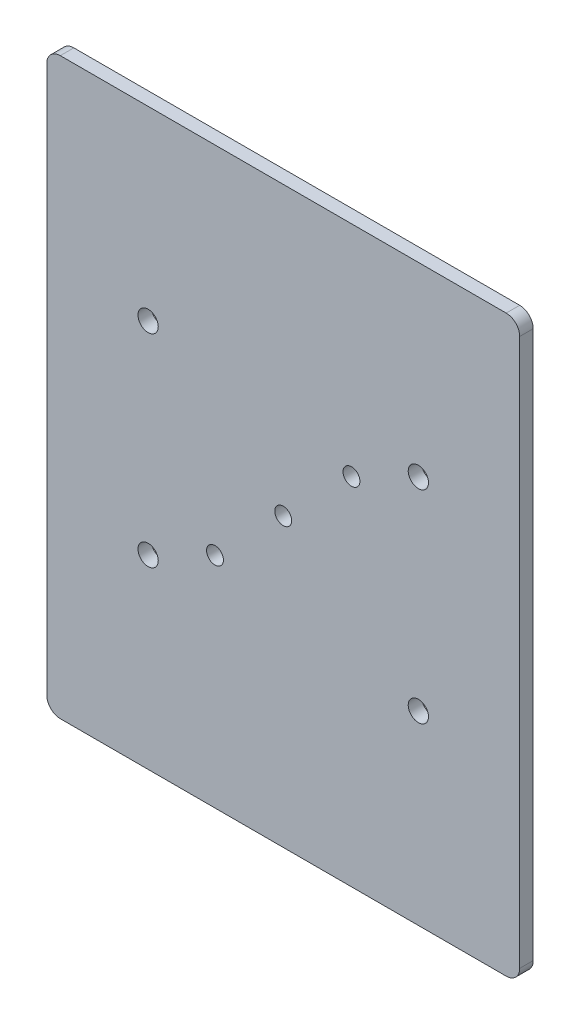
ISO-10303-21;
HEADER;
FILE_DESCRIPTION(('STEP AP214'),'2;1');
FILE_NAME('part.step','',(''),(''),'','','');
FILE_SCHEMA(('AUTOMOTIVE_DESIGN { 1 0 10303 214 1 1 1 1 }'));
ENDSEC;
DATA;
#1=APPLICATION_CONTEXT('core data for automotive mechanical design processes');
#2=APPLICATION_PROTOCOL_DEFINITION('international standard','automotive_design',2000,#1);
#3=PRODUCT_CONTEXT('',#1,'mechanical');
#4=PRODUCT('Part','Part','',(#3));
#5=PRODUCT_RELATED_PRODUCT_CATEGORY('part','',(#4));
#6=PRODUCT_DEFINITION_FORMATION('','',#4);
#7=PRODUCT_DEFINITION_CONTEXT('part definition',#1,'design');
#8=PRODUCT_DEFINITION('design','',#6,#7);
#9=PRODUCT_DEFINITION_SHAPE('','',#8);
#10=(LENGTH_UNIT() NAMED_UNIT(*) SI_UNIT(.MILLI.,.METRE.));
#11=(NAMED_UNIT(*) PLANE_ANGLE_UNIT() SI_UNIT($,.RADIAN.));
#12=(NAMED_UNIT(*) SI_UNIT($,.STERADIAN.) SOLID_ANGLE_UNIT());
#13=UNCERTAINTY_MEASURE_WITH_UNIT(LENGTH_MEASURE(1.E-05),#10,'distance_accuracy_value','');
#14=(GEOMETRIC_REPRESENTATION_CONTEXT(3) GLOBAL_UNCERTAINTY_ASSIGNED_CONTEXT((#13)) GLOBAL_UNIT_ASSIGNED_CONTEXT((#10,
#11,#12)) REPRESENTATION_CONTEXT('',''));
#15=CARTESIAN_POINT('',(0.,0.,0.));
#16=DIRECTION('',(0.,0.,1.));
#17=DIRECTION('',(1.,0.,0.));
#18=AXIS2_PLACEMENT_3D('',#15,#16,#17);
#19=CARTESIAN_POINT('',(0.,0.,2.));
#20=DIRECTION('',(0.,0.,1.));
#21=DIRECTION('',(1.,0.,0.));
#22=AXIS2_PLACEMENT_3D('',#19,#20,#21);
#23=PLANE('',#22);
#24=CARTESIAN_POINT('',(-10.1,-10.1,2.));
#25=DIRECTION('',(0.,0.,1.));
#26=DIRECTION('',(1.,0.,0.));
#27=AXIS2_PLACEMENT_3D('',#24,#25,#26);
#28=CIRCLE('',#27,1.25);
#29=CARTESIAN_POINT('',(-8.84999999999998,-10.1,2.));
#30=VERTEX_POINT('',#29);
#31=EDGE_CURVE('E214',#30,#30,#28,.T.);
#32=ORIENTED_EDGE('',*,*,#31,.F.);
#33=EDGE_LOOP('',(#32));
#34=FACE_BOUND('',#33,.T.);
#35=CARTESIAN_POINT('',(20.,-15.,2.));
#36=DIRECTION('',(0.,0.,1.));
#37=DIRECTION('',(1.,0.,0.));
#38=AXIS2_PLACEMENT_3D('',#35,#36,#37);
#39=CIRCLE('',#38,1.5);
#40=CARTESIAN_POINT('',(21.5,-15.,2.));
#41=VERTEX_POINT('',#40);
#42=EDGE_CURVE('E202',#41,#41,#39,.T.);
#43=ORIENTED_EDGE('',*,*,#42,.F.);
#44=EDGE_LOOP('',(#43));
#45=FACE_BOUND('',#44,.T.);
#46=CARTESIAN_POINT('',(20.,15.,2.));
#47=DIRECTION('',(0.,0.,1.));
#48=DIRECTION('',(1.,0.,0.));
#49=AXIS2_PLACEMENT_3D('',#46,#47,#48);
#50=CIRCLE('',#49,1.5);
#51=CARTESIAN_POINT('',(21.5,15.,2.));
#52=VERTEX_POINT('',#51);
#53=EDGE_CURVE('E191',#52,#52,#50,.T.);
#54=ORIENTED_EDGE('',*,*,#53,.F.);
#55=EDGE_LOOP('',(#54));
#56=FACE_BOUND('',#55,.T.);
#57=DIRECTION('',(1.,0.,0.));
#58=VECTOR('',#57,1.);
#59=CARTESIAN_POINT('',(-35.,-42.5,2.));
#60=LINE('',#59,#58);
#61=CARTESIAN_POINT('',(-33.,-42.5,2.));
#62=VERTEX_POINT('',#61);
#63=CARTESIAN_POINT('',(33.,-42.5,2.));
#64=VERTEX_POINT('',#63);
#65=EDGE_CURVE('E143',#62,#64,#60,.T.);
#66=ORIENTED_EDGE('',*,*,#65,.T.);
#67=CARTESIAN_POINT('',(33.,-40.5,2.));
#68=DIRECTION('',(0.,0.,1.));
#69=DIRECTION('',(1.,0.,0.));
#70=AXIS2_PLACEMENT_3D('',#67,#68,#69);
#71=CIRCLE('',#70,2.);
#72=CARTESIAN_POINT('',(35.,-40.5,2.));
#73=VERTEX_POINT('',#72);
#74=EDGE_CURVE('E161',#64,#73,#71,.T.);
#75=ORIENTED_EDGE('',*,*,#74,.T.);
#76=DIRECTION('',(0.,1.,0.));
#77=VECTOR('',#76,1.);
#78=CARTESIAN_POINT('',(35.,42.5,2.));
#79=LINE('',#78,#77);
#80=CARTESIAN_POINT('',(35.,40.5,2.));
#81=VERTEX_POINT('',#80);
#82=EDGE_CURVE('E125',#73,#81,#79,.T.);
#83=ORIENTED_EDGE('',*,*,#82,.T.);
#84=CARTESIAN_POINT('',(33.,40.5,2.));
#85=DIRECTION('',(0.,0.,1.));
#86=DIRECTION('',(1.,0.,0.));
#87=AXIS2_PLACEMENT_3D('',#84,#85,#86);
#88=CIRCLE('',#87,2.);
#89=CARTESIAN_POINT('',(33.,42.5,2.));
#90=VERTEX_POINT('',#89);
#91=EDGE_CURVE('E157',#81,#90,#88,.T.);
#92=ORIENTED_EDGE('',*,*,#91,.T.);
#93=DIRECTION('',(-1.,0.,0.));
#94=VECTOR('',#93,1.);
#95=CARTESIAN_POINT('',(-35.,42.5,2.));
#96=LINE('',#95,#94);
#97=CARTESIAN_POINT('',(-33.,42.5,2.));
#98=VERTEX_POINT('',#97);
#99=EDGE_CURVE('E170',#90,#98,#96,.T.);
#100=ORIENTED_EDGE('',*,*,#99,.T.);
#101=CARTESIAN_POINT('',(-33.,40.5,2.));
#102=DIRECTION('',(0.,0.,1.));
#103=DIRECTION('',(1.,0.,0.));
#104=AXIS2_PLACEMENT_3D('',#101,#102,#103);
#105=CIRCLE('',#104,2.);
#106=CARTESIAN_POINT('',(-35.,40.5,2.));
#107=VERTEX_POINT('',#106);
#108=EDGE_CURVE('E60',#98,#107,#105,.T.);
#109=ORIENTED_EDGE('',*,*,#108,.T.);
#110=DIRECTION('',(0.,-1.,0.));
#111=VECTOR('',#110,1.);
#112=CARTESIAN_POINT('',(-35.,42.5,2.));
#113=LINE('',#112,#111);
#114=CARTESIAN_POINT('',(-35.,-40.5,2.));
#115=VERTEX_POINT('',#114);
#116=EDGE_CURVE('E176',#107,#115,#113,.T.);
#117=ORIENTED_EDGE('',*,*,#116,.T.);
#118=CARTESIAN_POINT('',(-33.,-40.5,2.));
#119=DIRECTION('',(0.,0.,1.));
#120=DIRECTION('',(1.,0.,0.));
#121=AXIS2_PLACEMENT_3D('',#118,#119,#120);
#122=CIRCLE('',#121,2.);
#123=EDGE_CURVE('E159',#115,#62,#122,.T.);
#124=ORIENTED_EDGE('',*,*,#123,.T.);
#125=EDGE_LOOP('',(#66,#75,#83,#92,#100,#109,#117,#124));
#126=FACE_BOUND('',#125,.T.);
#127=CARTESIAN_POINT('',(-20.,15.,2.));
#128=DIRECTION('',(0.,0.,1.));
#129=DIRECTION('',(1.,0.,0.));
#130=AXIS2_PLACEMENT_3D('',#127,#128,#129);
#131=CIRCLE('',#130,1.5);
#132=CARTESIAN_POINT('',(-18.5,15.,2.));
#133=VERTEX_POINT('',#132);
#134=EDGE_CURVE('E134',#133,#133,#131,.T.);
#135=ORIENTED_EDGE('',*,*,#134,.F.);
#136=EDGE_LOOP('',(#135));
#137=FACE_BOUND('',#136,.T.);
#138=CARTESIAN_POINT('',(-20.,-15.,2.));
#139=DIRECTION('',(0.,0.,1.));
#140=DIRECTION('',(1.,0.,0.));
#141=AXIS2_PLACEMENT_3D('',#138,#139,#140);
#142=CIRCLE('',#141,1.5);
#143=CARTESIAN_POINT('',(-18.5,-15.,2.));
#144=VERTEX_POINT('',#143);
#145=EDGE_CURVE('E196',#144,#144,#142,.T.);
#146=ORIENTED_EDGE('',*,*,#145,.F.);
#147=EDGE_LOOP('',(#146));
#148=FACE_BOUND('',#147,.T.);
#149=CARTESIAN_POINT('',(10.1,10.1,2.));
#150=DIRECTION('',(0.,0.,1.));
#151=DIRECTION('',(1.,0.,0.));
#152=AXIS2_PLACEMENT_3D('',#149,#150,#151);
#153=CIRCLE('',#152,1.25);
#154=CARTESIAN_POINT('',(11.35,10.1,2.));
#155=VERTEX_POINT('',#154);
#156=EDGE_CURVE('E208',#155,#155,#153,.T.);
#157=ORIENTED_EDGE('',*,*,#156,.F.);
#158=EDGE_LOOP('',(#157));
#159=FACE_BOUND('',#158,.T.);
#160=CARTESIAN_POINT('',(0.,0.,2.));
#161=DIRECTION('',(0.,0.,1.));
#162=DIRECTION('',(1.,0.,0.));
#163=AXIS2_PLACEMENT_3D('',#160,#161,#162);
#164=CIRCLE('',#163,1.25);
#165=CARTESIAN_POINT('',(1.25,0.,2.));
#166=VERTEX_POINT('',#165);
#167=EDGE_CURVE('E220',#166,#166,#164,.T.);
#168=ORIENTED_EDGE('',*,*,#167,.F.);
#169=EDGE_LOOP('',(#168));
#170=FACE_BOUND('',#169,.T.);
#171=ADVANCED_FACE('F38',(#34,#45,#56,#126,#137,#148,#159,#170),#23,.T.);
#172=CARTESIAN_POINT('',(0.,0.,0.));
#173=DIRECTION('',(0.,0.,1.));
#174=DIRECTION('',(1.,0.,0.));
#175=AXIS2_PLACEMENT_3D('',#172,#173,#174);
#176=PLANE('',#175);
#177=DIRECTION('',(0.,1.,0.));
#178=VECTOR('',#177,1.);
#179=CARTESIAN_POINT('',(35.,42.5,0.));
#180=LINE('',#179,#178);
#181=CARTESIAN_POINT('',(35.,-40.5,0.));
#182=VERTEX_POINT('',#181);
#183=CARTESIAN_POINT('',(35.,40.5,0.));
#184=VERTEX_POINT('',#183);
#185=EDGE_CURVE('E122',#182,#184,#180,.T.);
#186=ORIENTED_EDGE('',*,*,#185,.F.);
#187=CARTESIAN_POINT('',(33.,-40.5,0.));
#188=DIRECTION('',(0.,0.,1.));
#189=DIRECTION('',(1.,0.,0.));
#190=AXIS2_PLACEMENT_3D('',#187,#188,#189);
#191=CIRCLE('',#190,2.);
#192=CARTESIAN_POINT('',(33.,-42.5,0.));
#193=VERTEX_POINT('',#192);
#194=EDGE_CURVE('E105',#182,#193,#191,.F.);
#195=ORIENTED_EDGE('',*,*,#194,.T.);
#196=DIRECTION('',(1.,0.,0.));
#197=VECTOR('',#196,1.);
#198=CARTESIAN_POINT('',(-35.,-42.5,0.));
#199=LINE('',#198,#197);
#200=CARTESIAN_POINT('',(-33.,-42.5,0.));
#201=VERTEX_POINT('',#200);
#202=EDGE_CURVE('E147',#201,#193,#199,.T.);
#203=ORIENTED_EDGE('',*,*,#202,.F.);
#204=CARTESIAN_POINT('',(-33.,-40.5,0.));
#205=DIRECTION('',(0.,0.,1.));
#206=DIRECTION('',(1.,0.,0.));
#207=AXIS2_PLACEMENT_3D('',#204,#205,#206);
#208=CIRCLE('',#207,2.);
#209=CARTESIAN_POINT('',(-35.,-40.5,0.));
#210=VERTEX_POINT('',#209);
#211=EDGE_CURVE('E116',#201,#210,#208,.F.);
#212=ORIENTED_EDGE('',*,*,#211,.T.);
#213=DIRECTION('',(0.,-1.,0.));
#214=VECTOR('',#213,1.);
#215=CARTESIAN_POINT('',(-35.,42.5,0.));
#216=LINE('',#215,#214);
#217=CARTESIAN_POINT('',(-35.,40.5,0.));
#218=VERTEX_POINT('',#217);
#219=EDGE_CURVE('E137',#218,#210,#216,.T.);
#220=ORIENTED_EDGE('',*,*,#219,.F.);
#221=CARTESIAN_POINT('',(-33.,40.5,0.));
#222=DIRECTION('',(0.,0.,1.));
#223=DIRECTION('',(1.,0.,0.));
#224=AXIS2_PLACEMENT_3D('',#221,#222,#223);
#225=CIRCLE('',#224,2.);
#226=CARTESIAN_POINT('',(-33.,42.5,0.));
#227=VERTEX_POINT('',#226);
#228=EDGE_CURVE('E126',#218,#227,#225,.F.);
#229=ORIENTED_EDGE('',*,*,#228,.T.);
#230=DIRECTION('',(-1.,0.,0.));
#231=VECTOR('',#230,1.);
#232=CARTESIAN_POINT('',(-35.,42.5,0.));
#233=LINE('',#232,#231);
#234=CARTESIAN_POINT('',(33.,42.5,0.));
#235=VERTEX_POINT('',#234);
#236=EDGE_CURVE('E133',#235,#227,#233,.T.);
#237=ORIENTED_EDGE('',*,*,#236,.F.);
#238=CARTESIAN_POINT('',(33.,40.5,0.));
#239=DIRECTION('',(0.,0.,1.));
#240=DIRECTION('',(1.,0.,0.));
#241=AXIS2_PLACEMENT_3D('',#238,#239,#240);
#242=CIRCLE('',#241,2.);
#243=EDGE_CURVE('E132',#235,#184,#242,.F.);
#244=ORIENTED_EDGE('',*,*,#243,.T.);
#245=EDGE_LOOP('',(#186,#195,#203,#212,#220,#229,#237,#244));
#246=FACE_BOUND('',#245,.T.);
#247=CARTESIAN_POINT('',(-20.,15.,0.));
#248=DIRECTION('',(0.,0.,1.));
#249=DIRECTION('',(1.,0.,0.));
#250=AXIS2_PLACEMENT_3D('',#247,#248,#249);
#251=CIRCLE('',#250,1.5);
#252=CARTESIAN_POINT('',(-18.5,15.,0.));
#253=VERTEX_POINT('',#252);
#254=EDGE_CURVE('E140',#253,#253,#251,.T.);
#255=ORIENTED_EDGE('',*,*,#254,.T.);
#256=EDGE_LOOP('',(#255));
#257=FACE_BOUND('',#256,.T.);
#258=CARTESIAN_POINT('',(20.,15.,0.));
#259=DIRECTION('',(0.,0.,1.));
#260=DIRECTION('',(1.,0.,0.));
#261=AXIS2_PLACEMENT_3D('',#258,#259,#260);
#262=CIRCLE('',#261,1.5);
#263=CARTESIAN_POINT('',(21.5,15.,0.));
#264=VERTEX_POINT('',#263);
#265=EDGE_CURVE('E193',#264,#264,#262,.T.);
#266=ORIENTED_EDGE('',*,*,#265,.T.);
#267=EDGE_LOOP('',(#266));
#268=FACE_BOUND('',#267,.T.);
#269=CARTESIAN_POINT('',(-20.,-15.,0.));
#270=DIRECTION('',(0.,0.,1.));
#271=DIRECTION('',(1.,0.,0.));
#272=AXIS2_PLACEMENT_3D('',#269,#270,#271);
#273=CIRCLE('',#272,1.5);
#274=CARTESIAN_POINT('',(-18.5,-15.,0.));
#275=VERTEX_POINT('',#274);
#276=EDGE_CURVE('E199',#275,#275,#273,.T.);
#277=ORIENTED_EDGE('',*,*,#276,.T.);
#278=EDGE_LOOP('',(#277));
#279=FACE_BOUND('',#278,.T.);
#280=CARTESIAN_POINT('',(20.,-15.,0.));
#281=DIRECTION('',(0.,0.,1.));
#282=DIRECTION('',(1.,0.,0.));
#283=AXIS2_PLACEMENT_3D('',#280,#281,#282);
#284=CIRCLE('',#283,1.5);
#285=CARTESIAN_POINT('',(21.5,-15.,0.));
#286=VERTEX_POINT('',#285);
#287=EDGE_CURVE('E205',#286,#286,#284,.T.);
#288=ORIENTED_EDGE('',*,*,#287,.T.);
#289=EDGE_LOOP('',(#288));
#290=FACE_BOUND('',#289,.T.);
#291=CARTESIAN_POINT('',(10.1,10.1,0.));
#292=DIRECTION('',(0.,0.,1.));
#293=DIRECTION('',(1.,0.,0.));
#294=AXIS2_PLACEMENT_3D('',#291,#292,#293);
#295=CIRCLE('',#294,1.25);
#296=CARTESIAN_POINT('',(11.35,10.1,0.));
#297=VERTEX_POINT('',#296);
#298=EDGE_CURVE('E211',#297,#297,#295,.T.);
#299=ORIENTED_EDGE('',*,*,#298,.T.);
#300=EDGE_LOOP('',(#299));
#301=FACE_BOUND('',#300,.T.);
#302=CARTESIAN_POINT('',(-10.1,-10.1,0.));
#303=DIRECTION('',(0.,0.,1.));
#304=DIRECTION('',(1.,0.,0.));
#305=AXIS2_PLACEMENT_3D('',#302,#303,#304);
#306=CIRCLE('',#305,1.25);
#307=CARTESIAN_POINT('',(-8.84999999999998,-10.1,0.));
#308=VERTEX_POINT('',#307);
#309=EDGE_CURVE('E217',#308,#308,#306,.T.);
#310=ORIENTED_EDGE('',*,*,#309,.T.);
#311=EDGE_LOOP('',(#310));
#312=FACE_BOUND('',#311,.T.);
#313=CARTESIAN_POINT('',(0.,0.,0.));
#314=DIRECTION('',(0.,0.,1.));
#315=DIRECTION('',(1.,0.,0.));
#316=AXIS2_PLACEMENT_3D('',#313,#314,#315);
#317=CIRCLE('',#316,1.25);
#318=CARTESIAN_POINT('',(1.25,0.,0.));
#319=VERTEX_POINT('',#318);
#320=EDGE_CURVE('E223',#319,#319,#317,.T.);
#321=ORIENTED_EDGE('',*,*,#320,.T.);
#322=EDGE_LOOP('',(#321));
#323=FACE_BOUND('',#322,.T.);
#324=ADVANCED_FACE('F129',(#246,#257,#268,#279,#290,#301,#312,#323),#176,.F.);
#325=CARTESIAN_POINT('',(35.,42.5,2.));
#326=DIRECTION('',(-1.,0.,0.));
#327=DIRECTION('',(0.,0.,1.));
#328=AXIS2_PLACEMENT_3D('',#325,#326,#327);
#329=PLANE('',#328);
#330=ORIENTED_EDGE('',*,*,#82,.F.);
#331=DIRECTION('',(0.,0.,-1.));
#332=VECTOR('',#331,1.);
#333=CARTESIAN_POINT('',(35.,-40.5,2.));
#334=LINE('',#333,#332);
#335=EDGE_CURVE('E109',#73,#182,#334,.T.);
#336=ORIENTED_EDGE('',*,*,#335,.T.);
#337=ORIENTED_EDGE('',*,*,#185,.T.);
#338=DIRECTION('',(0.,0.,-1.));
#339=VECTOR('',#338,1.);
#340=CARTESIAN_POINT('',(35.,40.5,2.));
#341=LINE('',#340,#339);
#342=EDGE_CURVE('E127',#184,#81,#341,.F.);
#343=ORIENTED_EDGE('',*,*,#342,.T.);
#344=EDGE_LOOP('',(#330,#336,#337,#343));
#345=FACE_BOUND('',#344,.T.);
#346=ADVANCED_FACE('F121',(#345),#329,.F.);
#347=CARTESIAN_POINT('',(-35.,42.5,2.));
#348=DIRECTION('',(0.,-1.,0.));
#349=DIRECTION('',(0.,0.,-1.));
#350=AXIS2_PLACEMENT_3D('',#347,#348,#349);
#351=PLANE('',#350);
#352=ORIENTED_EDGE('',*,*,#99,.F.);
#353=DIRECTION('',(0.,0.,-1.));
#354=VECTOR('',#353,1.);
#355=CARTESIAN_POINT('',(33.,42.5,2.));
#356=LINE('',#355,#354);
#357=EDGE_CURVE('E11',#90,#235,#356,.T.);
#358=ORIENTED_EDGE('',*,*,#357,.T.);
#359=ORIENTED_EDGE('',*,*,#236,.T.);
#360=DIRECTION('',(0.,0.,-1.));
#361=VECTOR('',#360,1.);
#362=CARTESIAN_POINT('',(-33.,42.5,2.));
#363=LINE('',#362,#361);
#364=EDGE_CURVE('E46',#227,#98,#363,.F.);
#365=ORIENTED_EDGE('',*,*,#364,.T.);
#366=EDGE_LOOP('',(#352,#358,#359,#365));
#367=FACE_BOUND('',#366,.T.);
#368=ADVANCED_FACE('F169',(#367),#351,.F.);
#369=CARTESIAN_POINT('',(-35.,42.5,2.));
#370=DIRECTION('',(1.,0.,0.));
#371=DIRECTION('',(0.,0.,-1.));
#372=AXIS2_PLACEMENT_3D('',#369,#370,#371);
#373=PLANE('',#372);
#374=ORIENTED_EDGE('',*,*,#219,.T.);
#375=DIRECTION('',(0.,0.,-1.));
#376=VECTOR('',#375,1.);
#377=CARTESIAN_POINT('',(-35.,-40.5,2.));
#378=LINE('',#377,#376);
#379=EDGE_CURVE('E53',#210,#115,#378,.F.);
#380=ORIENTED_EDGE('',*,*,#379,.T.);
#381=ORIENTED_EDGE('',*,*,#116,.F.);
#382=DIRECTION('',(0.,0.,-1.));
#383=VECTOR('',#382,1.);
#384=CARTESIAN_POINT('',(-35.,40.5,2.));
#385=LINE('',#384,#383);
#386=EDGE_CURVE('E163',#107,#218,#385,.T.);
#387=ORIENTED_EDGE('',*,*,#386,.T.);
#388=EDGE_LOOP('',(#374,#380,#381,#387));
#389=FACE_BOUND('',#388,.T.);
#390=ADVANCED_FACE('F180',(#389),#373,.F.);
#391=CARTESIAN_POINT('',(-35.,-42.5,2.));
#392=DIRECTION('',(0.,1.,0.));
#393=DIRECTION('',(0.,0.,1.));
#394=AXIS2_PLACEMENT_3D('',#391,#392,#393);
#395=PLANE('',#394);
#396=ORIENTED_EDGE('',*,*,#202,.T.);
#397=DIRECTION('',(0.,0.,-1.));
#398=VECTOR('',#397,1.);
#399=CARTESIAN_POINT('',(33.,-42.5,2.));
#400=LINE('',#399,#398);
#401=EDGE_CURVE('E110',#193,#64,#400,.F.);
#402=ORIENTED_EDGE('',*,*,#401,.T.);
#403=ORIENTED_EDGE('',*,*,#65,.F.);
#404=DIRECTION('',(0.,0.,-1.));
#405=VECTOR('',#404,1.);
#406=CARTESIAN_POINT('',(-33.,-42.5,2.));
#407=LINE('',#406,#405);
#408=EDGE_CURVE('E115',#62,#201,#407,.T.);
#409=ORIENTED_EDGE('',*,*,#408,.T.);
#410=EDGE_LOOP('',(#396,#402,#403,#409));
#411=FACE_BOUND('',#410,.T.);
#412=ADVANCED_FACE('F187',(#411),#395,.F.);
#413=CARTESIAN_POINT('',(-20.,15.,2.));
#414=DIRECTION('',(0.,0.,-1.));
#415=DIRECTION('',(-1.,0.,0.));
#416=AXIS2_PLACEMENT_3D('',#413,#414,#415);
#417=CYLINDRICAL_SURFACE('',#416,1.5);
#418=ORIENTED_EDGE('',*,*,#134,.T.);
#419=EDGE_LOOP('',(#418));
#420=FACE_BOUND('',#419,.T.);
#421=ORIENTED_EDGE('',*,*,#254,.F.);
#422=EDGE_LOOP('',(#421));
#423=FACE_BOUND('',#422,.T.);
#424=ADVANCED_FACE('F242',(#420,#423),#417,.F.);
#425=CARTESIAN_POINT('',(20.,15.,2.));
#426=DIRECTION('',(0.,0.,-1.));
#427=DIRECTION('',(-1.,0.,0.));
#428=AXIS2_PLACEMENT_3D('',#425,#426,#427);
#429=CYLINDRICAL_SURFACE('',#428,1.5);
#430=ORIENTED_EDGE('',*,*,#53,.T.);
#431=EDGE_LOOP('',(#430));
#432=FACE_BOUND('',#431,.T.);
#433=ORIENTED_EDGE('',*,*,#265,.F.);
#434=EDGE_LOOP('',(#433));
#435=FACE_BOUND('',#434,.T.);
#436=ADVANCED_FACE('F378',(#432,#435),#429,.F.);
#437=CARTESIAN_POINT('',(-20.,-15.,2.));
#438=DIRECTION('',(0.,0.,-1.));
#439=DIRECTION('',(-1.,0.,0.));
#440=AXIS2_PLACEMENT_3D('',#437,#438,#439);
#441=CYLINDRICAL_SURFACE('',#440,1.5);
#442=ORIENTED_EDGE('',*,*,#145,.T.);
#443=EDGE_LOOP('',(#442));
#444=FACE_BOUND('',#443,.T.);
#445=ORIENTED_EDGE('',*,*,#276,.F.);
#446=EDGE_LOOP('',(#445));
#447=FACE_BOUND('',#446,.T.);
#448=ADVANCED_FACE('F367',(#444,#447),#441,.F.);
#449=CARTESIAN_POINT('',(20.,-15.,2.));
#450=DIRECTION('',(0.,0.,-1.));
#451=DIRECTION('',(-1.,0.,0.));
#452=AXIS2_PLACEMENT_3D('',#449,#450,#451);
#453=CYLINDRICAL_SURFACE('',#452,1.5);
#454=ORIENTED_EDGE('',*,*,#42,.T.);
#455=EDGE_LOOP('',(#454));
#456=FACE_BOUND('',#455,.T.);
#457=ORIENTED_EDGE('',*,*,#287,.F.);
#458=EDGE_LOOP('',(#457));
#459=FACE_BOUND('',#458,.T.);
#460=ADVANCED_FACE('F356',(#456,#459),#453,.F.);
#461=CARTESIAN_POINT('',(10.1,10.1,2.));
#462=DIRECTION('',(0.,0.,-1.));
#463=DIRECTION('',(-1.,0.,0.));
#464=AXIS2_PLACEMENT_3D('',#461,#462,#463);
#465=CYLINDRICAL_SURFACE('',#464,1.25);
#466=ORIENTED_EDGE('',*,*,#156,.T.);
#467=EDGE_LOOP('',(#466));
#468=FACE_BOUND('',#467,.T.);
#469=ORIENTED_EDGE('',*,*,#298,.F.);
#470=EDGE_LOOP('',(#469));
#471=FACE_BOUND('',#470,.T.);
#472=ADVANCED_FACE('F345',(#468,#471),#465,.F.);
#473=CARTESIAN_POINT('',(-10.1,-10.1,2.));
#474=DIRECTION('',(0.,0.,-1.));
#475=DIRECTION('',(-1.,0.,0.));
#476=AXIS2_PLACEMENT_3D('',#473,#474,#475);
#477=CYLINDRICAL_SURFACE('',#476,1.25);
#478=ORIENTED_EDGE('',*,*,#31,.T.);
#479=EDGE_LOOP('',(#478));
#480=FACE_BOUND('',#479,.T.);
#481=ORIENTED_EDGE('',*,*,#309,.F.);
#482=EDGE_LOOP('',(#481));
#483=FACE_BOUND('',#482,.T.);
#484=ADVANCED_FACE('F335',(#480,#483),#477,.F.);
#485=CARTESIAN_POINT('',(0.,0.,2.));
#486=DIRECTION('',(0.,0.,-1.));
#487=DIRECTION('',(-1.,0.,0.));
#488=AXIS2_PLACEMENT_3D('',#485,#486,#487);
#489=CYLINDRICAL_SURFACE('',#488,1.25);
#490=ORIENTED_EDGE('',*,*,#167,.T.);
#491=EDGE_LOOP('',(#490));
#492=FACE_BOUND('',#491,.T.);
#493=ORIENTED_EDGE('',*,*,#320,.F.);
#494=EDGE_LOOP('',(#493));
#495=FACE_BOUND('',#494,.T.);
#496=ADVANCED_FACE('F229',(#492,#495),#489,.F.);
#497=CARTESIAN_POINT('',(33.,-40.5,2.));
#498=DIRECTION('',(0.,0.,-1.));
#499=DIRECTION('',(-1.,0.,0.));
#500=AXIS2_PLACEMENT_3D('',#497,#498,#499);
#501=CYLINDRICAL_SURFACE('',#500,2.);
#502=ORIENTED_EDGE('',*,*,#74,.F.);
#503=ORIENTED_EDGE('',*,*,#401,.F.);
#504=ORIENTED_EDGE('',*,*,#194,.F.);
#505=ORIENTED_EDGE('',*,*,#335,.F.);
#506=EDGE_LOOP('',(#502,#503,#504,#505));
#507=FACE_BOUND('',#506,.T.);
#508=ADVANCED_FACE('F108',(#507),#501,.T.);
#509=CARTESIAN_POINT('',(-33.,-40.5,2.));
#510=DIRECTION('',(0.,0.,-1.));
#511=DIRECTION('',(-1.,0.,0.));
#512=AXIS2_PLACEMENT_3D('',#509,#510,#511);
#513=CYLINDRICAL_SURFACE('',#512,2.);
#514=ORIENTED_EDGE('',*,*,#123,.F.);
#515=ORIENTED_EDGE('',*,*,#379,.F.);
#516=ORIENTED_EDGE('',*,*,#211,.F.);
#517=ORIENTED_EDGE('',*,*,#408,.F.);
#518=EDGE_LOOP('',(#514,#515,#516,#517));
#519=FACE_BOUND('',#518,.T.);
#520=ADVANCED_FACE('F184',(#519),#513,.T.);
#521=CARTESIAN_POINT('',(33.,40.5,2.));
#522=DIRECTION('',(0.,0.,-1.));
#523=DIRECTION('',(-1.,0.,0.));
#524=AXIS2_PLACEMENT_3D('',#521,#522,#523);
#525=CYLINDRICAL_SURFACE('',#524,2.);
#526=ORIENTED_EDGE('',*,*,#91,.F.);
#527=ORIENTED_EDGE('',*,*,#342,.F.);
#528=ORIENTED_EDGE('',*,*,#243,.F.);
#529=ORIENTED_EDGE('',*,*,#357,.F.);
#530=EDGE_LOOP('',(#526,#527,#528,#529));
#531=FACE_BOUND('',#530,.T.);
#532=ADVANCED_FACE('F256',(#531),#525,.T.);
#533=CARTESIAN_POINT('',(-33.,40.5,2.));
#534=DIRECTION('',(0.,0.,-1.));
#535=DIRECTION('',(-1.,0.,0.));
#536=AXIS2_PLACEMENT_3D('',#533,#534,#535);
#537=CYLINDRICAL_SURFACE('',#536,2.);
#538=ORIENTED_EDGE('',*,*,#108,.F.);
#539=ORIENTED_EDGE('',*,*,#364,.F.);
#540=ORIENTED_EDGE('',*,*,#228,.F.);
#541=ORIENTED_EDGE('',*,*,#386,.F.);
#542=EDGE_LOOP('',(#538,#539,#540,#541));
#543=FACE_BOUND('',#542,.T.);
#544=ADVANCED_FACE('F40',(#543),#537,.T.);
#545=CLOSED_SHELL('',(#171,#324,#346,#368,#390,#412,#424,#436,#448,#460,#472,#484,#496,#508,
#520,#532,#544));
#546=MANIFOLD_SOLID_BREP('B2',#545);
#547=ADVANCED_BREP_SHAPE_REPRESENTATION('',(#18,#546),#14);
#548=SHAPE_DEFINITION_REPRESENTATION(#9,#547);
ENDSEC;
END-ISO-10303-21;
